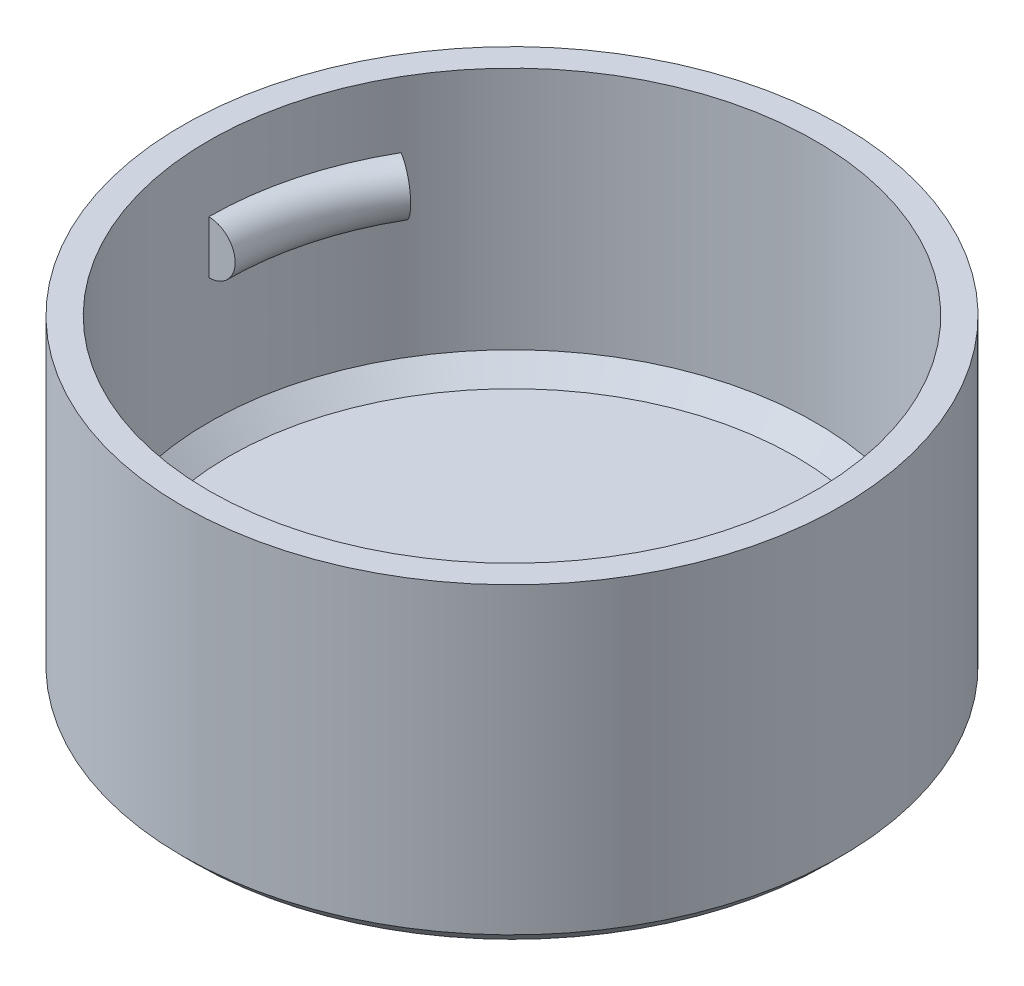
ISO-10303-21;
HEADER;
FILE_DESCRIPTION(('STEP AP214'),'2;1');
FILE_NAME('part.step','',(''),(''),'','','');
FILE_SCHEMA(('AUTOMOTIVE_DESIGN { 1 0 10303 214 1 1 1 1 }'));
ENDSEC;
DATA;
#1=APPLICATION_CONTEXT('core data for automotive mechanical design processes');
#2=APPLICATION_PROTOCOL_DEFINITION('international standard','automotive_design',2000,#1);
#3=PRODUCT_CONTEXT('',#1,'mechanical');
#4=PRODUCT('Part','Part','',(#3));
#5=PRODUCT_RELATED_PRODUCT_CATEGORY('part','',(#4));
#6=PRODUCT_DEFINITION_FORMATION('','',#4);
#7=PRODUCT_DEFINITION_CONTEXT('part definition',#1,'design');
#8=PRODUCT_DEFINITION('design','',#6,#7);
#9=PRODUCT_DEFINITION_SHAPE('','',#8);
#10=(LENGTH_UNIT() NAMED_UNIT(*) SI_UNIT(.MILLI.,.METRE.));
#11=(NAMED_UNIT(*) PLANE_ANGLE_UNIT() SI_UNIT($,.RADIAN.));
#12=(NAMED_UNIT(*) SI_UNIT($,.STERADIAN.) SOLID_ANGLE_UNIT());
#13=UNCERTAINTY_MEASURE_WITH_UNIT(LENGTH_MEASURE(1.E-05),#10,'distance_accuracy_value','');
#14=(GEOMETRIC_REPRESENTATION_CONTEXT(3) GLOBAL_UNCERTAINTY_ASSIGNED_CONTEXT((#13)) GLOBAL_UNIT_ASSIGNED_CONTEXT((#10,
#11,#12)) REPRESENTATION_CONTEXT('',''));
#15=CARTESIAN_POINT('',(0.,0.,0.));
#16=DIRECTION('',(0.,0.,1.));
#17=DIRECTION('',(1.,0.,0.));
#18=AXIS2_PLACEMENT_3D('',#15,#16,#17);
#19=CARTESIAN_POINT('',(0.,2.,0.));
#20=DIRECTION('',(0.,-1.,0.));
#21=DIRECTION('',(0.,0.,-1.));
#22=AXIS2_PLACEMENT_3D('',#19,#20,#21);
#23=CYLINDRICAL_SURFACE('',#22,12.5);
#24=CARTESIAN_POINT('',(0.,0.500000000000002,0.));
#25=DIRECTION('',(0.,1.,0.));
#26=DIRECTION('',(0.,0.,1.));
#27=AXIS2_PLACEMENT_3D('',#24,#25,#26);
#28=CIRCLE('',#27,12.5);
#29=CARTESIAN_POINT('',(0.,0.500000000000002,12.5));
#30=VERTEX_POINT('',#29);
#31=EDGE_CURVE('E121',#30,#30,#28,.T.);
#32=ORIENTED_EDGE('',*,*,#31,.T.);
#33=EDGE_LOOP('',(#32));
#34=FACE_BOUND('',#33,.T.);
#35=CARTESIAN_POINT('',(0.,12.,0.));
#36=DIRECTION('',(0.,1.,0.));
#37=DIRECTION('',(0.,0.,1.));
#38=AXIS2_PLACEMENT_3D('',#35,#36,#37);
#39=CIRCLE('',#38,12.5);
#40=CARTESIAN_POINT('',(0.,12.,12.5));
#41=VERTEX_POINT('',#40);
#42=EDGE_CURVE('E118',#41,#41,#39,.T.);
#43=ORIENTED_EDGE('',*,*,#42,.F.);
#44=EDGE_LOOP('',(#43));
#45=FACE_BOUND('',#44,.T.);
#46=ADVANCED_FACE('F39',(#34,#45),#23,.T.);
#47=CARTESIAN_POINT('',(0.,0.,0.));
#48=DIRECTION('',(0.,1.,0.));
#49=DIRECTION('',(0.,0.,1.));
#50=AXIS2_PLACEMENT_3D('',#47,#48,#49);
#51=PLANE('',#50);
#52=CARTESIAN_POINT('',(0.,0.,0.));
#53=DIRECTION('',(0.,1.,0.));
#54=DIRECTION('',(0.,0.,1.));
#55=AXIS2_PLACEMENT_3D('',#52,#53,#54);
#56=CIRCLE('',#55,12.);
#57=CARTESIAN_POINT('',(0.,0.,12.));
#58=VERTEX_POINT('',#57);
#59=EDGE_CURVE('E124',#58,#58,#56,.F.);
#60=ORIENTED_EDGE('',*,*,#59,.T.);
#61=EDGE_LOOP('',(#60));
#62=FACE_BOUND('',#61,.T.);
#63=ADVANCED_FACE('F139',(#62),#51,.F.);
#64=CARTESIAN_POINT('',(0.,12.,0.));
#65=DIRECTION('',(0.,1.,0.));
#66=DIRECTION('',(0.,0.,1.));
#67=AXIS2_PLACEMENT_3D('',#64,#65,#66);
#68=PLANE('',#67);
#69=ORIENTED_EDGE('',*,*,#42,.T.);
#70=EDGE_LOOP('',(#69));
#71=FACE_BOUND('',#70,.T.);
#72=CARTESIAN_POINT('',(0.,12.,0.));
#73=DIRECTION('',(0.,1.,0.));
#74=DIRECTION('',(0.,0.,1.));
#75=AXIS2_PLACEMENT_3D('',#72,#73,#74);
#76=CIRCLE('',#75,11.5);
#77=CARTESIAN_POINT('',(0.,12.,11.5));
#78=VERTEX_POINT('',#77);
#79=EDGE_CURVE('E115',#78,#78,#76,.T.);
#80=ORIENTED_EDGE('',*,*,#79,.F.);
#81=EDGE_LOOP('',(#80));
#82=FACE_BOUND('',#81,.T.);
#83=ADVANCED_FACE('F145',(#71,#82),#68,.T.);
#84=CARTESIAN_POINT('',(0.,12.,0.));
#85=DIRECTION('',(0.,-1.,0.));
#86=DIRECTION('',(0.,0.,-1.));
#87=AXIS2_PLACEMENT_3D('',#84,#85,#86);
#88=CYLINDRICAL_SURFACE('',#87,11.5);
#89=CARTESIAN_POINT('',(0.,2.75000000000001,0.));
#90=DIRECTION('',(0.,1.,0.));
#91=DIRECTION('',(0.,0.,1.));
#92=AXIS2_PLACEMENT_3D('',#89,#90,#91);
#93=CIRCLE('',#92,11.5);
#94=CARTESIAN_POINT('',(0.,2.75000000000001,11.5));
#95=VERTEX_POINT('',#94);
#96=EDGE_CURVE('E48',#95,#95,#93,.F.);
#97=ORIENTED_EDGE('',*,*,#96,.T.);
#98=EDGE_LOOP('',(#97));
#99=FACE_BOUND('',#98,.T.);
#100=DIRECTION('',(0.,1.,0.));
#101=VECTOR('',#100,1.);
#102=CARTESIAN_POINT('',(9.95929214352104,9.5,5.75000000000001));
#103=LINE('',#102,#101);
#104=CARTESIAN_POINT('',(9.95929214352104,7.5,5.75000000000001));
#105=VERTEX_POINT('',#104);
#106=CARTESIAN_POINT('',(9.95929214352104,9.5,5.75000000000001));
#107=VERTEX_POINT('',#106);
#108=EDGE_CURVE('E96',#105,#107,#103,.T.);
#109=ORIENTED_EDGE('',*,*,#108,.F.);
#110=CARTESIAN_POINT('',(0.,7.5,0.));
#111=DIRECTION('',(0.,1.,0.));
#112=DIRECTION('',(0.,0.,1.));
#113=AXIS2_PLACEMENT_3D('',#110,#111,#112);
#114=CIRCLE('',#113,11.5);
#115=CARTESIAN_POINT('',(11.5,7.5,0.));
#116=VERTEX_POINT('',#115);
#117=EDGE_CURVE('E81',#105,#116,#114,.T.);
#118=ORIENTED_EDGE('',*,*,#117,.T.);
#119=DIRECTION('',(0.,1.,0.));
#120=VECTOR('',#119,1.);
#121=CARTESIAN_POINT('',(11.5,9.5,0.));
#122=LINE('',#121,#120);
#123=CARTESIAN_POINT('',(11.5,9.50000000000001,0.));
#124=VERTEX_POINT('',#123);
#125=EDGE_CURVE('E86',#116,#124,#122,.T.);
#126=ORIENTED_EDGE('',*,*,#125,.T.);
#127=CARTESIAN_POINT('',(0.,9.5,0.));
#128=DIRECTION('',(0.,1.,0.));
#129=DIRECTION('',(0.,0.,1.));
#130=AXIS2_PLACEMENT_3D('',#127,#128,#129);
#131=CIRCLE('',#130,11.5);
#132=EDGE_CURVE('E84',#107,#124,#131,.T.);
#133=ORIENTED_EDGE('',*,*,#132,.F.);
#134=EDGE_LOOP('',(#109,#118,#126,#133));
#135=FACE_BOUND('',#134,.T.);
#136=DIRECTION('',(0.,-1.,0.));
#137=VECTOR('',#136,1.);
#138=CARTESIAN_POINT('',(-9.95929214352104,9.5,-5.75000000000001));
#139=LINE('',#138,#137);
#140=CARTESIAN_POINT('',(-9.95929214352104,9.5,-5.75000000000001));
#141=VERTEX_POINT('',#140);
#142=CARTESIAN_POINT('',(-9.95929214352104,7.5,-5.75000000000001));
#143=VERTEX_POINT('',#142);
#144=EDGE_CURVE('E107',#141,#143,#139,.T.);
#145=ORIENTED_EDGE('',*,*,#144,.T.);
#146=CARTESIAN_POINT('',(0.,7.5,0.));
#147=DIRECTION('',(0.,1.,0.));
#148=DIRECTION('',(0.,0.,1.));
#149=AXIS2_PLACEMENT_3D('',#146,#147,#148);
#150=CIRCLE('',#149,11.5);
#151=CARTESIAN_POINT('',(-11.5,7.5,0.));
#152=VERTEX_POINT('',#151);
#153=EDGE_CURVE('E112',#143,#152,#150,.T.);
#154=ORIENTED_EDGE('',*,*,#153,.T.);
#155=DIRECTION('',(0.,-1.,0.));
#156=VECTOR('',#155,1.);
#157=CARTESIAN_POINT('',(-11.5,9.5,0.));
#158=LINE('',#157,#156);
#159=CARTESIAN_POINT('',(-11.5,9.5,0.));
#160=VERTEX_POINT('',#159);
#161=EDGE_CURVE('E98',#160,#152,#158,.T.);
#162=ORIENTED_EDGE('',*,*,#161,.F.);
#163=CARTESIAN_POINT('',(0.,9.5,0.));
#164=DIRECTION('',(0.,1.,0.));
#165=DIRECTION('',(0.,0.,1.));
#166=AXIS2_PLACEMENT_3D('',#163,#164,#165);
#167=CIRCLE('',#166,11.5);
#168=EDGE_CURVE('E110',#141,#160,#167,.T.);
#169=ORIENTED_EDGE('',*,*,#168,.F.);
#170=EDGE_LOOP('',(#145,#154,#162,#169));
#171=FACE_BOUND('',#170,.T.);
#172=ORIENTED_EDGE('',*,*,#79,.T.);
#173=EDGE_LOOP('',(#172));
#174=FACE_BOUND('',#173,.T.);
#175=ADVANCED_FACE('F93',(#99,#135,#171,#174),#88,.F.);
#176=CARTESIAN_POINT('',(0.,2.,0.));
#177=DIRECTION('',(0.,1.,0.));
#178=DIRECTION('',(0.,0.,1.));
#179=AXIS2_PLACEMENT_3D('',#176,#177,#178);
#180=PLANE('',#179);
#181=CARTESIAN_POINT('',(0.,2.,0.));
#182=DIRECTION('',(0.,1.,0.));
#183=DIRECTION('',(0.,0.,1.));
#184=AXIS2_PLACEMENT_3D('',#181,#182,#183);
#185=CIRCLE('',#184,10.75);
#186=CARTESIAN_POINT('',(0.,2.,10.75));
#187=VERTEX_POINT('',#186);
#188=EDGE_CURVE('E11',#187,#187,#185,.T.);
#189=ORIENTED_EDGE('',*,*,#188,.T.);
#190=EDGE_LOOP('',(#189));
#191=FACE_BOUND('',#190,.T.);
#192=ADVANCED_FACE('F155',(#191),#180,.T.);
#193=CARTESIAN_POINT('',(0.,8.5,0.));
#194=DIRECTION('',(0.,1.,0.));
#195=DIRECTION('',(0.,0.,1.));
#196=AXIS2_PLACEMENT_3D('',#193,#194,#195);
#197=TOROIDAL_SURFACE('',#196,11.5,1.);
#198=ORIENTED_EDGE('',*,*,#153,.F.);
#199=CARTESIAN_POINT('',(-9.95929214352104,8.5,-5.75000000000001));
#200=DIRECTION('',(-0.500000000000001,0.,0.866025403784438));
#201=DIRECTION('',(-0.866025403784438,0.,-0.500000000000001));
#202=AXIS2_PLACEMENT_3D('',#199,#200,#201);
#203=CIRCLE('',#202,1.);
#204=EDGE_CURVE('E104',#143,#141,#203,.T.);
#205=ORIENTED_EDGE('',*,*,#204,.T.);
#206=ORIENTED_EDGE('',*,*,#168,.T.);
#207=CARTESIAN_POINT('',(-11.5,8.5,0.));
#208=DIRECTION('',(0.,0.,1.));
#209=DIRECTION('',(-1.,0.,0.));
#210=AXIS2_PLACEMENT_3D('',#207,#208,#209);
#211=CIRCLE('',#210,1.);
#212=EDGE_CURVE('E61',#152,#160,#211,.T.);
#213=ORIENTED_EDGE('',*,*,#212,.F.);
#214=EDGE_LOOP('',(#198,#205,#206,#213));
#215=FACE_BOUND('',#214,.T.);
#216=ADVANCED_FACE('F158',(#215),#197,.T.);
#217=CARTESIAN_POINT('',(-9.95929214352104,8.5,-5.75000000000001));
#218=DIRECTION('',(0.500000000000001,0.,-0.866025403784438));
#219=DIRECTION('',(-0.866025403784438,0.,-0.500000000000001));
#220=AXIS2_PLACEMENT_3D('',#217,#218,#219);
#221=PLANE('',#220);
#222=ORIENTED_EDGE('',*,*,#204,.F.);
#223=ORIENTED_EDGE('',*,*,#144,.F.);
#224=EDGE_LOOP('',(#222,#223));
#225=FACE_BOUND('',#224,.T.);
#226=ADVANCED_FACE('F167',(#225),#221,.T.);
#227=CARTESIAN_POINT('',(-11.5,8.5,0.));
#228=DIRECTION('',(0.,0.,-1.));
#229=DIRECTION('',(-1.,0.,0.));
#230=AXIS2_PLACEMENT_3D('',#227,#228,#229);
#231=PLANE('',#230);
#232=ORIENTED_EDGE('',*,*,#212,.T.);
#233=ORIENTED_EDGE('',*,*,#161,.T.);
#234=EDGE_LOOP('',(#232,#233));
#235=FACE_BOUND('',#234,.T.);
#236=ADVANCED_FACE('F171',(#235),#231,.F.);
#237=CARTESIAN_POINT('',(0.,8.5,0.));
#238=DIRECTION('',(0.,1.,0.));
#239=DIRECTION('',(0.,0.,1.));
#240=AXIS2_PLACEMENT_3D('',#237,#238,#239);
#241=TOROIDAL_SURFACE('',#240,11.5,1.);
#242=ORIENTED_EDGE('',*,*,#117,.F.);
#243=CARTESIAN_POINT('',(9.95929214352104,8.5,5.75000000000001));
#244=DIRECTION('',(-0.500000000000001,0.,0.866025403784438));
#245=DIRECTION('',(0.866025403784438,0.,0.500000000000001));
#246=AXIS2_PLACEMENT_3D('',#243,#244,#245);
#247=CIRCLE('',#246,1.);
#248=EDGE_CURVE('E90',#107,#105,#247,.T.);
#249=ORIENTED_EDGE('',*,*,#248,.F.);
#250=ORIENTED_EDGE('',*,*,#132,.T.);
#251=CARTESIAN_POINT('',(11.5,8.5,0.));
#252=DIRECTION('',(0.,0.,1.));
#253=DIRECTION('',(1.,0.,0.));
#254=AXIS2_PLACEMENT_3D('',#251,#252,#253);
#255=CIRCLE('',#254,1.);
#256=EDGE_CURVE('E54',#124,#116,#255,.T.);
#257=ORIENTED_EDGE('',*,*,#256,.T.);
#258=EDGE_LOOP('',(#242,#249,#250,#257));
#259=FACE_BOUND('',#258,.T.);
#260=ADVANCED_FACE('F79',(#259),#241,.T.);
#261=CARTESIAN_POINT('',(9.95929214352104,8.5,5.75000000000001));
#262=DIRECTION('',(-0.500000000000001,0.,0.866025403784438));
#263=DIRECTION('',(0.866025403784438,0.,0.500000000000001));
#264=AXIS2_PLACEMENT_3D('',#261,#262,#263);
#265=PLANE('',#264);
#266=ORIENTED_EDGE('',*,*,#248,.T.);
#267=ORIENTED_EDGE('',*,*,#108,.T.);
#268=EDGE_LOOP('',(#266,#267));
#269=FACE_BOUND('',#268,.T.);
#270=ADVANCED_FACE('F177',(#269),#265,.T.);
#271=CARTESIAN_POINT('',(11.5,8.5,0.));
#272=DIRECTION('',(0.,0.,1.));
#273=DIRECTION('',(1.,0.,0.));
#274=AXIS2_PLACEMENT_3D('',#271,#272,#273);
#275=PLANE('',#274);
#276=ORIENTED_EDGE('',*,*,#256,.F.);
#277=ORIENTED_EDGE('',*,*,#125,.F.);
#278=EDGE_LOOP('',(#276,#277));
#279=FACE_BOUND('',#278,.T.);
#280=ADVANCED_FACE('F88',(#279),#275,.F.);
#281=CARTESIAN_POINT('',(0.,0.500000000000002,0.));
#282=DIRECTION('',(0.,1.,0.));
#283=DIRECTION('',(0.,0.,1.));
#284=AXIS2_PLACEMENT_3D('',#281,#282,#283);
#285=CONICAL_SURFACE('',#284,12.5,0.785398163397452);
#286=ORIENTED_EDGE('',*,*,#59,.F.);
#287=EDGE_LOOP('',(#286));
#288=FACE_BOUND('',#287,.T.);
#289=ORIENTED_EDGE('',*,*,#31,.F.);
#290=EDGE_LOOP('',(#289));
#291=FACE_BOUND('',#290,.T.);
#292=ADVANCED_FACE('F131',(#288,#291),#285,.T.);
#293=CARTESIAN_POINT('',(0.,2.75000000000001,0.));
#294=DIRECTION('',(0.,1.,0.));
#295=DIRECTION('',(0.,0.,1.));
#296=AXIS2_PLACEMENT_3D('',#293,#294,#295);
#297=CONICAL_SURFACE('',#296,11.5,0.785398163397443);
#298=ORIENTED_EDGE('',*,*,#188,.F.);
#299=EDGE_LOOP('',(#298));
#300=FACE_BOUND('',#299,.T.);
#301=ORIENTED_EDGE('',*,*,#96,.F.);
#302=EDGE_LOOP('',(#301));
#303=FACE_BOUND('',#302,.T.);
#304=ADVANCED_FACE('F42',(#300,#303),#297,.F.);
#305=CLOSED_SHELL('',(#46,#63,#83,#175,#192,#216,#226,#236,#260,#270,#280,#292,#304));
#306=MANIFOLD_SOLID_BREP('B2',#305);
#307=ADVANCED_BREP_SHAPE_REPRESENTATION('',(#18,#306),#14);
#308=SHAPE_DEFINITION_REPRESENTATION(#9,#307);
ENDSEC;
END-ISO-10303-21;
